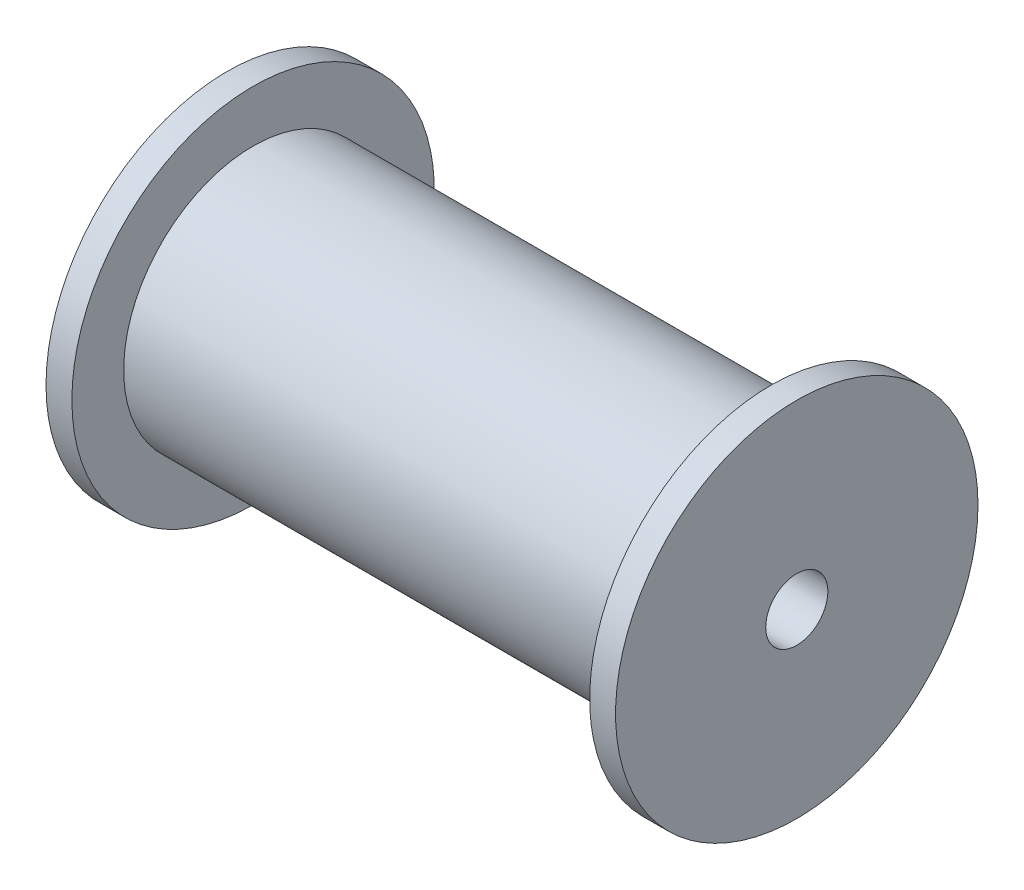
ISO-10303-21;
HEADER;
FILE_DESCRIPTION(('STEP AP214'),'2;1');
FILE_NAME('part.step','',(''),(''),'','','');
FILE_SCHEMA(('AUTOMOTIVE_DESIGN { 1 0 10303 214 1 1 1 1 }'));
ENDSEC;
DATA;
#1=APPLICATION_CONTEXT('core data for automotive mechanical design processes');
#2=APPLICATION_PROTOCOL_DEFINITION('international standard','automotive_design',2000,#1);
#3=PRODUCT_CONTEXT('',#1,'mechanical');
#4=PRODUCT('Part','Part','',(#3));
#5=PRODUCT_RELATED_PRODUCT_CATEGORY('part','',(#4));
#6=PRODUCT_DEFINITION_FORMATION('','',#4);
#7=PRODUCT_DEFINITION_CONTEXT('part definition',#1,'design');
#8=PRODUCT_DEFINITION('design','',#6,#7);
#9=PRODUCT_DEFINITION_SHAPE('','',#8);
#10=(LENGTH_UNIT() NAMED_UNIT(*) SI_UNIT(.MILLI.,.METRE.));
#11=(NAMED_UNIT(*) PLANE_ANGLE_UNIT() SI_UNIT($,.RADIAN.));
#12=(NAMED_UNIT(*) SI_UNIT($,.STERADIAN.) SOLID_ANGLE_UNIT());
#13=UNCERTAINTY_MEASURE_WITH_UNIT(LENGTH_MEASURE(1.E-05),#10,'distance_accuracy_value','');
#14=(GEOMETRIC_REPRESENTATION_CONTEXT(3) GLOBAL_UNCERTAINTY_ASSIGNED_CONTEXT((#13)) GLOBAL_UNIT_ASSIGNED_CONTEXT((#10,
#11,#12)) REPRESENTATION_CONTEXT('',''));
#15=CARTESIAN_POINT('',(0.,0.,0.));
#16=DIRECTION('',(0.,0.,1.));
#17=DIRECTION('',(1.,0.,0.));
#18=AXIS2_PLACEMENT_3D('',#15,#16,#17);
#19=CARTESIAN_POINT('',(200.,0.,0.));
#20=DIRECTION('',(1.,0.,0.));
#21=DIRECTION('',(0.,0.,-1.));
#22=AXIS2_PLACEMENT_3D('',#19,#20,#21);
#23=CYLINDRICAL_SURFACE('',#22,70.);
#24=CARTESIAN_POINT('',(200.,0.,0.));
#25=DIRECTION('',(1.,0.,0.));
#26=DIRECTION('',(0.,0.,-1.));
#27=AXIS2_PLACEMENT_3D('',#24,#25,#26);
#28=CIRCLE('',#27,70.);
#29=CARTESIAN_POINT('',(200.,0.,-70.));
#30=VERTEX_POINT('',#29);
#31=EDGE_CURVE('E48',#30,#30,#28,.T.);
#32=ORIENTED_EDGE('',*,*,#31,.T.);
#33=EDGE_LOOP('',(#32));
#34=FACE_BOUND('',#33,.T.);
#35=CARTESIAN_POINT('',(210.,0.,0.));
#36=DIRECTION('',(1.,0.,0.));
#37=DIRECTION('',(0.,0.,-1.));
#38=AXIS2_PLACEMENT_3D('',#35,#36,#37);
#39=CIRCLE('',#38,70.);
#40=CARTESIAN_POINT('',(210.,0.,-70.));
#41=VERTEX_POINT('',#40);
#42=EDGE_CURVE('E26',#41,#41,#39,.F.);
#43=ORIENTED_EDGE('',*,*,#42,.T.);
#44=EDGE_LOOP('',(#43));
#45=FACE_BOUND('',#44,.T.);
#46=ADVANCED_FACE('F23',(#34,#45),#23,.T.);
#47=CARTESIAN_POINT('',(210.,0.,0.));
#48=DIRECTION('',(1.,0.,0.));
#49=DIRECTION('',(0.,0.,-1.));
#50=AXIS2_PLACEMENT_3D('',#47,#48,#49);
#51=PLANE('',#50);
#52=CARTESIAN_POINT('',(210.,0.,0.));
#53=DIRECTION('',(-1.,0.,0.));
#54=DIRECTION('',(0.,0.,1.));
#55=AXIS2_PLACEMENT_3D('',#52,#53,#54);
#56=CIRCLE('',#55,12.);
#57=CARTESIAN_POINT('',(210.,0.,12.));
#58=VERTEX_POINT('',#57);
#59=EDGE_CURVE('E46',#58,#58,#56,.T.);
#60=ORIENTED_EDGE('',*,*,#59,.T.);
#61=EDGE_LOOP('',(#60));
#62=FACE_BOUND('',#61,.T.);
#63=ORIENTED_EDGE('',*,*,#42,.F.);
#64=EDGE_LOOP('',(#63));
#65=FACE_BOUND('',#64,.T.);
#66=ADVANCED_FACE('F56',(#62,#65),#51,.T.);
#67=CARTESIAN_POINT('',(200.,0.,0.));
#68=DIRECTION('',(1.,0.,0.));
#69=DIRECTION('',(0.,0.,-1.));
#70=AXIS2_PLACEMENT_3D('',#67,#68,#69);
#71=PLANE('',#70);
#72=CARTESIAN_POINT('',(200.,0.,0.));
#73=DIRECTION('',(1.,0.,0.));
#74=DIRECTION('',(0.,0.,-1.));
#75=AXIS2_PLACEMENT_3D('',#72,#73,#74);
#76=CIRCLE('',#75,50.);
#77=CARTESIAN_POINT('',(200.,0.,-50.));
#78=VERTEX_POINT('',#77);
#79=EDGE_CURVE('E43',#78,#78,#76,.T.);
#80=ORIENTED_EDGE('',*,*,#79,.T.);
#81=EDGE_LOOP('',(#80));
#82=FACE_BOUND('',#81,.T.);
#83=ORIENTED_EDGE('',*,*,#31,.F.);
#84=EDGE_LOOP('',(#83));
#85=FACE_BOUND('',#84,.T.);
#86=ADVANCED_FACE('F58',(#82,#85),#71,.F.);
#87=CARTESIAN_POINT('',(210.,0.,0.));
#88=DIRECTION('',(-1.,0.,0.));
#89=DIRECTION('',(0.,0.,1.));
#90=AXIS2_PLACEMENT_3D('',#87,#88,#89);
#91=CYLINDRICAL_SURFACE('',#90,12.);
#92=ORIENTED_EDGE('',*,*,#59,.F.);
#93=EDGE_LOOP('',(#92));
#94=FACE_BOUND('',#93,.T.);
#95=CARTESIAN_POINT('',(-10.,0.,-2.54426109809932E-13));
#96=DIRECTION('',(-1.,0.,0.));
#97=DIRECTION('',(0.,0.,1.));
#98=AXIS2_PLACEMENT_3D('',#95,#96,#97);
#99=CIRCLE('',#98,12.);
#100=CARTESIAN_POINT('',(-10.,0.,11.9999999999997));
#101=VERTEX_POINT('',#100);
#102=EDGE_CURVE('E40',#101,#101,#99,.T.);
#103=ORIENTED_EDGE('',*,*,#102,.T.);
#104=EDGE_LOOP('',(#103));
#105=FACE_BOUND('',#104,.T.);
#106=ADVANCED_FACE('F65',(#94,#105),#91,.F.);
#107=CARTESIAN_POINT('',(0.,0.,0.));
#108=DIRECTION('',(1.,0.,0.));
#109=DIRECTION('',(0.,0.,-1.));
#110=AXIS2_PLACEMENT_3D('',#107,#108,#109);
#111=CYLINDRICAL_SURFACE('',#110,50.);
#112=CARTESIAN_POINT('',(0.,0.,0.));
#113=DIRECTION('',(1.,0.,0.));
#114=DIRECTION('',(0.,0.,-1.));
#115=AXIS2_PLACEMENT_3D('',#112,#113,#114);
#116=CIRCLE('',#115,50.);
#117=CARTESIAN_POINT('',(0.,0.,-50.));
#118=VERTEX_POINT('',#117);
#119=EDGE_CURVE('E35',#118,#118,#116,.T.);
#120=ORIENTED_EDGE('',*,*,#119,.T.);
#121=EDGE_LOOP('',(#120));
#122=FACE_BOUND('',#121,.T.);
#123=ORIENTED_EDGE('',*,*,#79,.F.);
#124=EDGE_LOOP('',(#123));
#125=FACE_BOUND('',#124,.T.);
#126=ADVANCED_FACE('F83',(#122,#125),#111,.T.);
#127=CARTESIAN_POINT('',(-10.,0.,0.));
#128=DIRECTION('',(-1.,0.,0.));
#129=DIRECTION('',(0.,0.,1.));
#130=AXIS2_PLACEMENT_3D('',#127,#128,#129);
#131=PLANE('',#130);
#132=ORIENTED_EDGE('',*,*,#102,.F.);
#133=EDGE_LOOP('',(#132));
#134=FACE_BOUND('',#133,.T.);
#135=CARTESIAN_POINT('',(-10.,0.,0.));
#136=DIRECTION('',(-1.,0.,0.));
#137=DIRECTION('',(0.,0.,1.));
#138=AXIS2_PLACEMENT_3D('',#135,#136,#137);
#139=CIRCLE('',#138,70.);
#140=CARTESIAN_POINT('',(-10.,0.,70.));
#141=VERTEX_POINT('',#140);
#142=EDGE_CURVE('E30',#141,#141,#139,.T.);
#143=ORIENTED_EDGE('',*,*,#142,.T.);
#144=EDGE_LOOP('',(#143));
#145=FACE_BOUND('',#144,.T.);
#146=ADVANCED_FACE('F76',(#134,#145),#131,.T.);
#147=CARTESIAN_POINT('',(0.,0.,0.));
#148=DIRECTION('',(1.,0.,0.));
#149=DIRECTION('',(0.,0.,-1.));
#150=AXIS2_PLACEMENT_3D('',#147,#148,#149);
#151=PLANE('',#150);
#152=ORIENTED_EDGE('',*,*,#119,.F.);
#153=EDGE_LOOP('',(#152));
#154=FACE_BOUND('',#153,.T.);
#155=CARTESIAN_POINT('',(0.,0.,0.));
#156=DIRECTION('',(-1.,0.,0.));
#157=DIRECTION('',(0.,0.,1.));
#158=AXIS2_PLACEMENT_3D('',#155,#156,#157);
#159=CIRCLE('',#158,70.);
#160=CARTESIAN_POINT('',(0.,0.,70.));
#161=VERTEX_POINT('',#160);
#162=EDGE_CURVE('E12',#161,#161,#159,.F.);
#163=ORIENTED_EDGE('',*,*,#162,.T.);
#164=EDGE_LOOP('',(#163));
#165=FACE_BOUND('',#164,.T.);
#166=ADVANCED_FACE('F70',(#154,#165),#151,.T.);
#167=CARTESIAN_POINT('',(0.,0.,0.));
#168=DIRECTION('',(-1.,0.,0.));
#169=DIRECTION('',(0.,0.,1.));
#170=AXIS2_PLACEMENT_3D('',#167,#168,#169);
#171=CYLINDRICAL_SURFACE('',#170,70.);
#172=ORIENTED_EDGE('',*,*,#162,.F.);
#173=EDGE_LOOP('',(#172));
#174=FACE_BOUND('',#173,.T.);
#175=ORIENTED_EDGE('',*,*,#142,.F.);
#176=EDGE_LOOP('',(#175));
#177=FACE_BOUND('',#176,.T.);
#178=ADVANCED_FACE('F68',(#174,#177),#171,.T.);
#179=CLOSED_SHELL('',(#46,#66,#86,#106,#126,#146,#166,#178));
#180=MANIFOLD_SOLID_BREP('B1',#179);
#181=ADVANCED_BREP_SHAPE_REPRESENTATION('',(#18,#180),#14);
#182=SHAPE_DEFINITION_REPRESENTATION(#9,#181);
ENDSEC;
END-ISO-10303-21;
